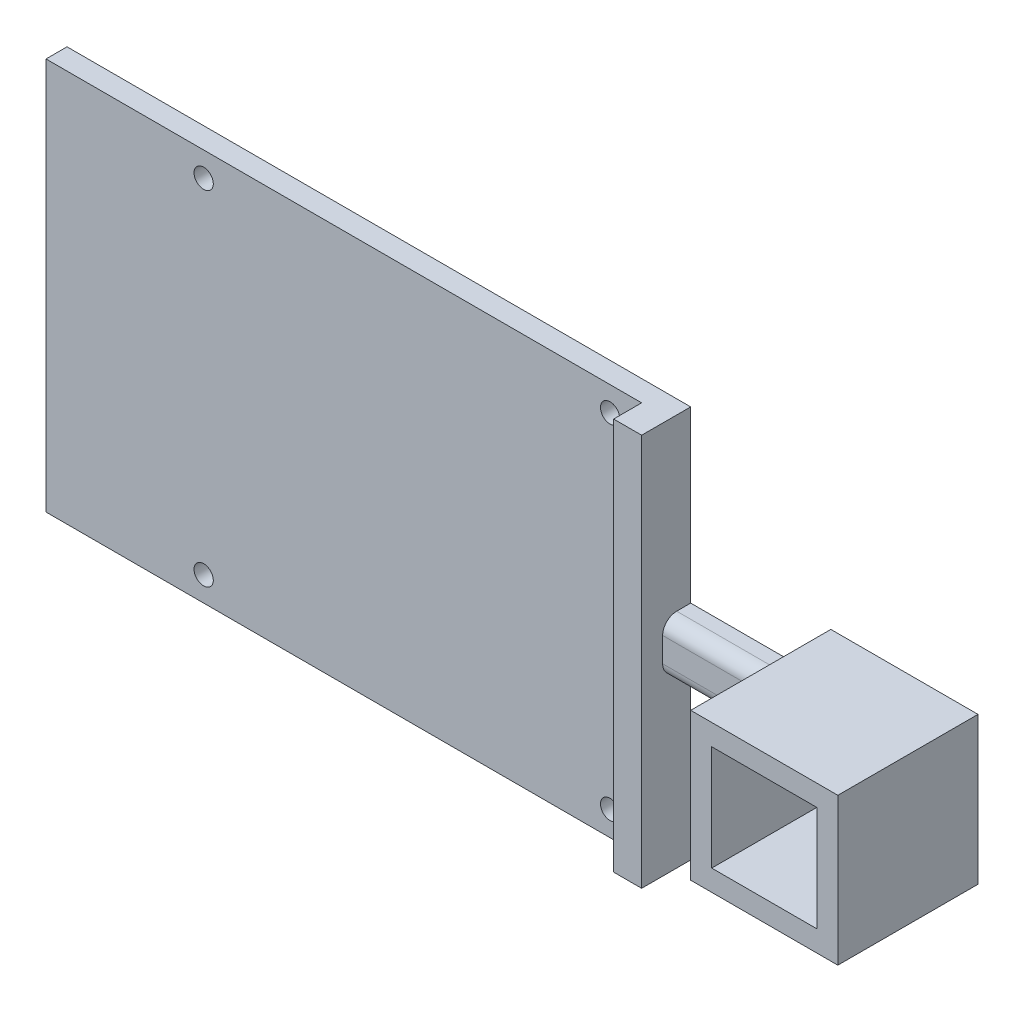
ISO-10303-21;
HEADER;
FILE_DESCRIPTION(('STEP AP214'),'2;1');
FILE_NAME('part.step','',(''),(''),'','','');
FILE_SCHEMA(('AUTOMOTIVE_DESIGN { 1 0 10303 214 1 1 1 1 }'));
ENDSEC;
DATA;
#1=APPLICATION_CONTEXT('core data for automotive mechanical design processes');
#2=APPLICATION_PROTOCOL_DEFINITION('international standard','automotive_design',2000,#1);
#3=PRODUCT_CONTEXT('',#1,'mechanical');
#4=PRODUCT('Part','Part','',(#3));
#5=PRODUCT_RELATED_PRODUCT_CATEGORY('part','',(#4));
#6=PRODUCT_DEFINITION_FORMATION('','',#4);
#7=PRODUCT_DEFINITION_CONTEXT('part definition',#1,'design');
#8=PRODUCT_DEFINITION('design','',#6,#7);
#9=PRODUCT_DEFINITION_SHAPE('','',#8);
#10=(LENGTH_UNIT() NAMED_UNIT(*) SI_UNIT(.MILLI.,.METRE.));
#11=(NAMED_UNIT(*) PLANE_ANGLE_UNIT() SI_UNIT($,.RADIAN.));
#12=(NAMED_UNIT(*) SI_UNIT($,.STERADIAN.) SOLID_ANGLE_UNIT());
#13=UNCERTAINTY_MEASURE_WITH_UNIT(LENGTH_MEASURE(1.E-05),#10,'distance_accuracy_value','');
#14=(GEOMETRIC_REPRESENTATION_CONTEXT(3) GLOBAL_UNCERTAINTY_ASSIGNED_CONTEXT((#13)) GLOBAL_UNIT_ASSIGNED_CONTEXT((#10,
#11,#12)) REPRESENTATION_CONTEXT('',''));
#15=CARTESIAN_POINT('',(0.,0.,0.));
#16=DIRECTION('',(0.,0.,1.));
#17=DIRECTION('',(1.,0.,0.));
#18=AXIS2_PLACEMENT_3D('',#15,#16,#17);
#19=CARTESIAN_POINT('',(-34.5,0.,0.));
#20=DIRECTION('',(1.,0.,0.));
#21=DIRECTION('',(0.,0.,-1.));
#22=AXIS2_PLACEMENT_3D('',#19,#20,#21);
#23=PLANE('',#22);
#24=DIRECTION('',(0.,1.,0.));
#25=VECTOR('',#24,1.);
#26=CARTESIAN_POINT('',(-34.5,28.,3.));
#27=LINE('',#26,#25);
#28=CARTESIAN_POINT('',(-34.5,-28.,3.));
#29=VERTEX_POINT('',#28);
#30=CARTESIAN_POINT('',(-34.5,28.,3.));
#31=VERTEX_POINT('',#30);
#32=EDGE_CURVE('E48',#29,#31,#27,.T.);
#33=ORIENTED_EDGE('',*,*,#32,.F.);
#34=DIRECTION('',(0.,0.,1.));
#35=VECTOR('',#34,1.);
#36=CARTESIAN_POINT('',(-34.5,-28.,0.));
#37=LINE('',#36,#35);
#38=CARTESIAN_POINT('',(-34.5,-28.,7.));
#39=VERTEX_POINT('',#38);
#40=EDGE_CURVE('E209',#29,#39,#37,.T.);
#41=ORIENTED_EDGE('',*,*,#40,.T.);
#42=DIRECTION('',(0.,1.,0.));
#43=VECTOR('',#42,1.);
#44=CARTESIAN_POINT('',(-34.5,-28.,7.));
#45=LINE('',#44,#43);
#46=CARTESIAN_POINT('',(-34.5,28.,7.));
#47=VERTEX_POINT('',#46);
#48=EDGE_CURVE('E211',#39,#47,#45,.T.);
#49=ORIENTED_EDGE('',*,*,#48,.T.);
#50=DIRECTION('',(0.,0.,-1.));
#51=VECTOR('',#50,1.);
#52=CARTESIAN_POINT('',(-34.5,28.,0.));
#53=LINE('',#52,#51);
#54=EDGE_CURVE('E214',#47,#31,#53,.T.);
#55=ORIENTED_EDGE('',*,*,#54,.T.);
#56=EDGE_LOOP('',(#33,#41,#49,#55));
#57=FACE_BOUND('',#56,.T.);
#58=ADVANCED_FACE('F33',(#57),#23,.F.);
#59=CARTESIAN_POINT('',(-10.5,-10.5,20.));
#60=DIRECTION('',(1.,0.,0.));
#61=DIRECTION('',(0.,0.,-1.));
#62=AXIS2_PLACEMENT_3D('',#59,#60,#61);
#63=PLANE('',#62);
#64=DIRECTION('',(0.,0.,-1.));
#65=VECTOR('',#64,1.);
#66=CARTESIAN_POINT('',(-10.5,3.75,0.));
#67=LINE('',#66,#65);
#68=CARTESIAN_POINT('',(-10.5,3.75,2.));
#69=VERTEX_POINT('',#68);
#70=CARTESIAN_POINT('',(-10.5,3.75,0.));
#71=VERTEX_POINT('',#70);
#72=EDGE_CURVE('E235',#69,#71,#67,.T.);
#73=ORIENTED_EDGE('',*,*,#72,.F.);
#74=CARTESIAN_POINT('',(-10.5,1.75000000000001,2.));
#75=DIRECTION('',(1.,0.,0.));
#76=DIRECTION('',(0.,0.,-1.));
#77=AXIS2_PLACEMENT_3D('',#74,#75,#76);
#78=CIRCLE('',#77,2.);
#79=CARTESIAN_POINT('',(-10.5,1.75000000000001,4.));
#80=VERTEX_POINT('',#79);
#81=EDGE_CURVE('E11',#69,#80,#78,.T.);
#82=ORIENTED_EDGE('',*,*,#81,.T.);
#83=DIRECTION('',(0.,1.,0.));
#84=VECTOR('',#83,1.);
#85=CARTESIAN_POINT('',(-10.5,3.75000000000001,4.));
#86=LINE('',#85,#84);
#87=CARTESIAN_POINT('',(-10.5,-1.74999999999999,4.));
#88=VERTEX_POINT('',#87);
#89=EDGE_CURVE('E244',#88,#80,#86,.T.);
#90=ORIENTED_EDGE('',*,*,#89,.F.);
#91=CARTESIAN_POINT('',(-10.5,-1.74999999999999,2.));
#92=DIRECTION('',(1.,0.,0.));
#93=DIRECTION('',(0.,0.,-1.));
#94=AXIS2_PLACEMENT_3D('',#91,#92,#93);
#95=CIRCLE('',#94,2.);
#96=CARTESIAN_POINT('',(-10.5,-3.74999999999999,2.));
#97=VERTEX_POINT('',#96);
#98=EDGE_CURVE('E41',#88,#97,#95,.T.);
#99=ORIENTED_EDGE('',*,*,#98,.T.);
#100=DIRECTION('',(0.,0.,1.));
#101=VECTOR('',#100,1.);
#102=CARTESIAN_POINT('',(-10.5,-3.74999999999999,0.));
#103=LINE('',#102,#101);
#104=CARTESIAN_POINT('',(-10.5,-3.74999999999999,0.));
#105=VERTEX_POINT('',#104);
#106=EDGE_CURVE('E181',#105,#97,#103,.T.);
#107=ORIENTED_EDGE('',*,*,#106,.F.);
#108=DIRECTION('',(0.,-1.,0.));
#109=VECTOR('',#108,1.);
#110=CARTESIAN_POINT('',(-10.5,-10.5,0.));
#111=LINE('',#110,#109);
#112=CARTESIAN_POINT('',(-10.5,-10.5,0.));
#113=VERTEX_POINT('',#112);
#114=EDGE_CURVE('E279',#105,#113,#111,.T.);
#115=ORIENTED_EDGE('',*,*,#114,.T.);
#116=DIRECTION('',(0.,0.,-1.));
#117=VECTOR('',#116,1.);
#118=CARTESIAN_POINT('',(-10.5,-10.5,20.));
#119=LINE('',#118,#117);
#120=CARTESIAN_POINT('',(-10.5,-10.5,20.));
#121=VERTEX_POINT('',#120);
#122=EDGE_CURVE('E313',#121,#113,#119,.T.);
#123=ORIENTED_EDGE('',*,*,#122,.F.);
#124=DIRECTION('',(0.,-1.,0.));
#125=VECTOR('',#124,1.);
#126=CARTESIAN_POINT('',(-10.5,-10.5,20.));
#127=LINE('',#126,#125);
#128=CARTESIAN_POINT('',(-10.5,10.5,20.));
#129=VERTEX_POINT('',#128);
#130=EDGE_CURVE('E286',#129,#121,#127,.T.);
#131=ORIENTED_EDGE('',*,*,#130,.F.);
#132=DIRECTION('',(0.,0.,-1.));
#133=VECTOR('',#132,1.);
#134=CARTESIAN_POINT('',(-10.5,10.5,20.));
#135=LINE('',#134,#133);
#136=CARTESIAN_POINT('',(-10.5,10.5,0.));
#137=VERTEX_POINT('',#136);
#138=EDGE_CURVE('E296',#129,#137,#135,.T.);
#139=ORIENTED_EDGE('',*,*,#138,.T.);
#140=EDGE_CURVE('E297',#137,#71,#111,.T.);
#141=ORIENTED_EDGE('',*,*,#140,.T.);
#142=EDGE_LOOP('',(#73,#82,#90,#99,#107,#115,#123,#131,#139,#141));
#143=FACE_BOUND('',#142,.T.);
#144=ADVANCED_FACE('F333',(#143),#63,.F.);
#145=CARTESIAN_POINT('',(10.5,-10.5,20.));
#146=DIRECTION('',(0.,1.,0.));
#147=DIRECTION('',(-1.,0.,0.));
#148=AXIS2_PLACEMENT_3D('',#145,#146,#147);
#149=PLANE('',#148);
#150=DIRECTION('',(1.,0.,0.));
#151=VECTOR('',#150,1.);
#152=CARTESIAN_POINT('',(10.5,-10.5,0.));
#153=LINE('',#152,#151);
#154=CARTESIAN_POINT('',(10.5,-10.5,0.));
#155=VERTEX_POINT('',#154);
#156=EDGE_CURVE('E300',#113,#155,#153,.T.);
#157=ORIENTED_EDGE('',*,*,#156,.T.);
#158=DIRECTION('',(0.,0.,-1.));
#159=VECTOR('',#158,1.);
#160=CARTESIAN_POINT('',(10.5,-10.5,20.));
#161=LINE('',#160,#159);
#162=CARTESIAN_POINT('',(10.5,-10.5,20.));
#163=VERTEX_POINT('',#162);
#164=EDGE_CURVE('E310',#163,#155,#161,.T.);
#165=ORIENTED_EDGE('',*,*,#164,.F.);
#166=DIRECTION('',(1.,0.,0.));
#167=VECTOR('',#166,1.);
#168=CARTESIAN_POINT('',(10.5,-10.5,20.));
#169=LINE('',#168,#167);
#170=EDGE_CURVE('E289',#121,#163,#169,.T.);
#171=ORIENTED_EDGE('',*,*,#170,.F.);
#172=ORIENTED_EDGE('',*,*,#122,.T.);
#173=EDGE_LOOP('',(#157,#165,#171,#172));
#174=FACE_BOUND('',#173,.T.);
#175=ADVANCED_FACE('F349',(#174),#149,.F.);
#176=CARTESIAN_POINT('',(10.5,-10.5,20.));
#177=DIRECTION('',(-1.,0.,0.));
#178=DIRECTION('',(0.,0.,1.));
#179=AXIS2_PLACEMENT_3D('',#176,#177,#178);
#180=PLANE('',#179);
#181=DIRECTION('',(0.,1.,0.));
#182=VECTOR('',#181,1.);
#183=CARTESIAN_POINT('',(10.5,-10.5,0.));
#184=LINE('',#183,#182);
#185=CARTESIAN_POINT('',(10.5,10.5,0.));
#186=VERTEX_POINT('',#185);
#187=EDGE_CURVE('E302',#155,#186,#184,.T.);
#188=ORIENTED_EDGE('',*,*,#187,.T.);
#189=DIRECTION('',(0.,0.,-1.));
#190=VECTOR('',#189,1.);
#191=CARTESIAN_POINT('',(10.5,10.5,20.));
#192=LINE('',#191,#190);
#193=CARTESIAN_POINT('',(10.5,10.5,20.));
#194=VERTEX_POINT('',#193);
#195=EDGE_CURVE('E307',#194,#186,#192,.T.);
#196=ORIENTED_EDGE('',*,*,#195,.F.);
#197=DIRECTION('',(0.,1.,0.));
#198=VECTOR('',#197,1.);
#199=CARTESIAN_POINT('',(10.5,-10.5,20.));
#200=LINE('',#199,#198);
#201=EDGE_CURVE('E292',#163,#194,#200,.T.);
#202=ORIENTED_EDGE('',*,*,#201,.F.);
#203=ORIENTED_EDGE('',*,*,#164,.T.);
#204=EDGE_LOOP('',(#188,#196,#202,#203));
#205=FACE_BOUND('',#204,.T.);
#206=ADVANCED_FACE('F410',(#205),#180,.F.);
#207=CARTESIAN_POINT('',(10.5,10.5,20.));
#208=DIRECTION('',(0.,-1.,0.));
#209=DIRECTION('',(1.,0.,0.));
#210=AXIS2_PLACEMENT_3D('',#207,#208,#209);
#211=PLANE('',#210);
#212=DIRECTION('',(-1.,0.,0.));
#213=VECTOR('',#212,1.);
#214=CARTESIAN_POINT('',(10.5,10.5,0.));
#215=LINE('',#214,#213);
#216=EDGE_CURVE('E290',#186,#137,#215,.T.);
#217=ORIENTED_EDGE('',*,*,#216,.T.);
#218=ORIENTED_EDGE('',*,*,#138,.F.);
#219=DIRECTION('',(-1.,0.,0.));
#220=VECTOR('',#219,1.);
#221=CARTESIAN_POINT('',(10.5,10.5,20.));
#222=LINE('',#221,#220);
#223=EDGE_CURVE('E294',#194,#129,#222,.T.);
#224=ORIENTED_EDGE('',*,*,#223,.F.);
#225=ORIENTED_EDGE('',*,*,#195,.T.);
#226=EDGE_LOOP('',(#217,#218,#224,#225));
#227=FACE_BOUND('',#226,.T.);
#228=ADVANCED_FACE('F358',(#227),#211,.F.);
#229=CARTESIAN_POINT('',(0.,0.,20.));
#230=DIRECTION('',(0.,0.,1.));
#231=DIRECTION('',(1.,0.,0.));
#232=AXIS2_PLACEMENT_3D('',#229,#230,#231);
#233=PLANE('',#232);
#234=DIRECTION('',(0.,-1.,0.));
#235=VECTOR('',#234,1.);
#236=CARTESIAN_POINT('',(-7.5,-7.5,20.));
#237=LINE('',#236,#235);
#238=CARTESIAN_POINT('',(-7.5,7.5,20.));
#239=VERTEX_POINT('',#238);
#240=CARTESIAN_POINT('',(-7.5,-7.5,20.));
#241=VERTEX_POINT('',#240);
#242=EDGE_CURVE('E253',#239,#241,#237,.T.);
#243=ORIENTED_EDGE('',*,*,#242,.F.);
#244=DIRECTION('',(-1.,0.,0.));
#245=VECTOR('',#244,1.);
#246=CARTESIAN_POINT('',(7.5,7.5,20.));
#247=LINE('',#246,#245);
#248=CARTESIAN_POINT('',(7.5,7.5,20.));
#249=VERTEX_POINT('',#248);
#250=EDGE_CURVE('E258',#249,#239,#247,.T.);
#251=ORIENTED_EDGE('',*,*,#250,.F.);
#252=DIRECTION('',(0.,1.,0.));
#253=VECTOR('',#252,1.);
#254=CARTESIAN_POINT('',(7.5,-7.5,20.));
#255=LINE('',#254,#253);
#256=CARTESIAN_POINT('',(7.5,-7.5,20.));
#257=VERTEX_POINT('',#256);
#258=EDGE_CURVE('E272',#257,#249,#255,.T.);
#259=ORIENTED_EDGE('',*,*,#258,.F.);
#260=DIRECTION('',(1.,0.,0.));
#261=VECTOR('',#260,1.);
#262=CARTESIAN_POINT('',(7.5,-7.5,20.));
#263=LINE('',#262,#261);
#264=EDGE_CURVE('E269',#241,#257,#263,.T.);
#265=ORIENTED_EDGE('',*,*,#264,.F.);
#266=EDGE_LOOP('',(#243,#251,#259,#265));
#267=FACE_BOUND('',#266,.T.);
#268=ORIENTED_EDGE('',*,*,#130,.T.);
#269=ORIENTED_EDGE('',*,*,#170,.T.);
#270=ORIENTED_EDGE('',*,*,#201,.T.);
#271=ORIENTED_EDGE('',*,*,#223,.T.);
#272=EDGE_LOOP('',(#268,#269,#270,#271));
#273=FACE_BOUND('',#272,.T.);
#274=ADVANCED_FACE('F353',(#267,#273),#233,.T.);
#275=CARTESIAN_POINT('',(0.,0.,0.));
#276=DIRECTION('',(0.,0.,1.));
#277=DIRECTION('',(1.,0.,0.));
#278=AXIS2_PLACEMENT_3D('',#275,#276,#277);
#279=PLANE('',#278);
#280=CARTESIAN_POINT('',(-39.,24.5,0.));
#281=DIRECTION('',(0.,0.,1.));
#282=DIRECTION('',(1.,0.,0.));
#283=AXIS2_PLACEMENT_3D('',#280,#281,#282);
#284=CIRCLE('',#283,1.375);
#285=CARTESIAN_POINT('',(-37.625,24.5,0.));
#286=VERTEX_POINT('',#285);
#287=EDGE_CURVE('E198',#286,#286,#284,.T.);
#288=ORIENTED_EDGE('',*,*,#287,.T.);
#289=EDGE_LOOP('',(#288));
#290=FACE_BOUND('',#289,.T.);
#291=CARTESIAN_POINT('',(-97.,-24.5,0.));
#292=DIRECTION('',(0.,0.,1.));
#293=DIRECTION('',(1.,0.,0.));
#294=AXIS2_PLACEMENT_3D('',#291,#292,#293);
#295=CIRCLE('',#294,1.375);
#296=CARTESIAN_POINT('',(-95.625,-24.5,0.));
#297=VERTEX_POINT('',#296);
#298=EDGE_CURVE('E593',#297,#297,#295,.T.);
#299=ORIENTED_EDGE('',*,*,#298,.T.);
#300=EDGE_LOOP('',(#299));
#301=FACE_BOUND('',#300,.T.);
#302=CARTESIAN_POINT('',(-97.,24.5,0.));
#303=DIRECTION('',(0.,0.,1.));
#304=DIRECTION('',(1.,0.,0.));
#305=AXIS2_PLACEMENT_3D('',#302,#303,#304);
#306=CIRCLE('',#305,1.375);
#307=CARTESIAN_POINT('',(-95.625,24.5,0.));
#308=VERTEX_POINT('',#307);
#309=EDGE_CURVE('E595',#308,#308,#306,.T.);
#310=ORIENTED_EDGE('',*,*,#309,.T.);
#311=EDGE_LOOP('',(#310));
#312=FACE_BOUND('',#311,.T.);
#313=CARTESIAN_POINT('',(-39.,-24.5,0.));
#314=DIRECTION('',(0.,0.,1.));
#315=DIRECTION('',(1.,0.,0.));
#316=AXIS2_PLACEMENT_3D('',#313,#314,#315);
#317=CIRCLE('',#316,1.375);
#318=CARTESIAN_POINT('',(-37.625,-24.5,0.));
#319=VERTEX_POINT('',#318);
#320=EDGE_CURVE('E599',#319,#319,#317,.T.);
#321=ORIENTED_EDGE('',*,*,#320,.T.);
#322=EDGE_LOOP('',(#321));
#323=FACE_BOUND('',#322,.T.);
#324=DIRECTION('',(-1.,0.,0.));
#325=VECTOR('',#324,1.);
#326=CARTESIAN_POINT('',(7.5,7.5,0.));
#327=LINE('',#326,#325);
#328=CARTESIAN_POINT('',(7.5,7.5,0.));
#329=VERTEX_POINT('',#328);
#330=CARTESIAN_POINT('',(-7.5,7.5,0.));
#331=VERTEX_POINT('',#330);
#332=EDGE_CURVE('E264',#329,#331,#327,.T.);
#333=ORIENTED_EDGE('',*,*,#332,.T.);
#334=DIRECTION('',(0.,-1.,0.));
#335=VECTOR('',#334,1.);
#336=CARTESIAN_POINT('',(-7.5,-7.5,0.));
#337=LINE('',#336,#335);
#338=CARTESIAN_POINT('',(-7.5,-7.5,0.));
#339=VERTEX_POINT('',#338);
#340=EDGE_CURVE('E254',#331,#339,#337,.T.);
#341=ORIENTED_EDGE('',*,*,#340,.T.);
#342=DIRECTION('',(1.,0.,0.));
#343=VECTOR('',#342,1.);
#344=CARTESIAN_POINT('',(7.5,-7.5,0.));
#345=LINE('',#344,#343);
#346=CARTESIAN_POINT('',(7.5,-7.5,0.));
#347=VERTEX_POINT('',#346);
#348=EDGE_CURVE('E257',#339,#347,#345,.T.);
#349=ORIENTED_EDGE('',*,*,#348,.T.);
#350=DIRECTION('',(0.,1.,0.));
#351=VECTOR('',#350,1.);
#352=CARTESIAN_POINT('',(7.5,-7.5,0.));
#353=LINE('',#352,#351);
#354=EDGE_CURVE('E261',#347,#329,#353,.T.);
#355=ORIENTED_EDGE('',*,*,#354,.T.);
#356=EDGE_LOOP('',(#333,#341,#349,#355));
#357=FACE_BOUND('',#356,.T.);
#358=ORIENTED_EDGE('',*,*,#140,.F.);
#359=ORIENTED_EDGE('',*,*,#216,.F.);
#360=ORIENTED_EDGE('',*,*,#187,.F.);
#361=ORIENTED_EDGE('',*,*,#156,.F.);
#362=ORIENTED_EDGE('',*,*,#114,.F.);
#363=DIRECTION('',(1.,0.,0.));
#364=VECTOR('',#363,1.);
#365=CARTESIAN_POINT('',(-30.5,-3.74999999999999,0.));
#366=LINE('',#365,#364);
#367=CARTESIAN_POINT('',(-30.5,-3.74999999999999,0.));
#368=VERTEX_POINT('',#367);
#369=EDGE_CURVE('E250',#368,#105,#366,.T.);
#370=ORIENTED_EDGE('',*,*,#369,.F.);
#371=DIRECTION('',(0.,-1.,0.));
#372=VECTOR('',#371,1.);
#373=CARTESIAN_POINT('',(-30.5,-28.,0.));
#374=LINE('',#373,#372);
#375=CARTESIAN_POINT('',(-30.5,-28.,0.));
#376=VERTEX_POINT('',#375);
#377=EDGE_CURVE('E178',#368,#376,#374,.T.);
#378=ORIENTED_EDGE('',*,*,#377,.T.);
#379=DIRECTION('',(1.,0.,0.));
#380=VECTOR('',#379,1.);
#381=CARTESIAN_POINT('',(-34.5,-28.,0.));
#382=LINE('',#381,#380);
#383=CARTESIAN_POINT('',(-119.5,-28.,0.));
#384=VERTEX_POINT('',#383);
#385=EDGE_CURVE('E169',#384,#376,#382,.T.);
#386=ORIENTED_EDGE('',*,*,#385,.F.);
#387=DIRECTION('',(0.,-1.,0.));
#388=VECTOR('',#387,1.);
#389=CARTESIAN_POINT('',(-119.5,28.,0.));
#390=LINE('',#389,#388);
#391=CARTESIAN_POINT('',(-119.5,28.,0.));
#392=VERTEX_POINT('',#391);
#393=EDGE_CURVE('E175',#392,#384,#390,.T.);
#394=ORIENTED_EDGE('',*,*,#393,.F.);
#395=DIRECTION('',(1.,0.,0.));
#396=VECTOR('',#395,1.);
#397=CARTESIAN_POINT('',(-34.5,28.,0.));
#398=LINE('',#397,#396);
#399=CARTESIAN_POINT('',(-30.5,28.,0.));
#400=VERTEX_POINT('',#399);
#401=EDGE_CURVE('E216',#392,#400,#398,.T.);
#402=ORIENTED_EDGE('',*,*,#401,.T.);
#403=CARTESIAN_POINT('',(-30.5,3.75000000000001,0.));
#404=VERTEX_POINT('',#403);
#405=EDGE_CURVE('E217',#400,#404,#374,.T.);
#406=ORIENTED_EDGE('',*,*,#405,.T.);
#407=DIRECTION('',(1.,0.,0.));
#408=VECTOR('',#407,1.);
#409=CARTESIAN_POINT('',(-30.5,3.75,0.));
#410=LINE('',#409,#408);
#411=EDGE_CURVE('E241',#404,#71,#410,.T.);
#412=ORIENTED_EDGE('',*,*,#411,.T.);
#413=EDGE_LOOP('',(#358,#359,#360,#361,#362,#370,#378,#386,#394,#402,#406,#412));
#414=FACE_BOUND('',#413,.T.);
#415=ADVANCED_FACE('F172',(#290,#301,#312,#323,#357,#414),#279,.F.);
#416=CARTESIAN_POINT('',(-7.5,-7.5,0.));
#417=DIRECTION('',(-1.,0.,0.));
#418=DIRECTION('',(0.,0.,1.));
#419=AXIS2_PLACEMENT_3D('',#416,#417,#418);
#420=PLANE('',#419);
#421=ORIENTED_EDGE('',*,*,#242,.T.);
#422=DIRECTION('',(0.,0.,1.));
#423=VECTOR('',#422,1.);
#424=CARTESIAN_POINT('',(-7.5,-7.5,0.));
#425=LINE('',#424,#423);
#426=EDGE_CURVE('E267',#339,#241,#425,.T.);
#427=ORIENTED_EDGE('',*,*,#426,.F.);
#428=ORIENTED_EDGE('',*,*,#340,.F.);
#429=DIRECTION('',(0.,0.,1.));
#430=VECTOR('',#429,1.);
#431=CARTESIAN_POINT('',(-7.5,7.5,0.));
#432=LINE('',#431,#430);
#433=EDGE_CURVE('E277',#331,#239,#432,.T.);
#434=ORIENTED_EDGE('',*,*,#433,.T.);
#435=EDGE_LOOP('',(#421,#427,#428,#434));
#436=FACE_BOUND('',#435,.T.);
#437=ADVANCED_FACE('F417',(#436),#420,.F.);
#438=CARTESIAN_POINT('',(7.5,7.5,0.));
#439=DIRECTION('',(0.,1.,0.));
#440=DIRECTION('',(-1.,0.,0.));
#441=AXIS2_PLACEMENT_3D('',#438,#439,#440);
#442=PLANE('',#441);
#443=ORIENTED_EDGE('',*,*,#250,.T.);
#444=ORIENTED_EDGE('',*,*,#433,.F.);
#445=ORIENTED_EDGE('',*,*,#332,.F.);
#446=DIRECTION('',(0.,0.,1.));
#447=VECTOR('',#446,1.);
#448=CARTESIAN_POINT('',(7.5,7.5,0.));
#449=LINE('',#448,#447);
#450=EDGE_CURVE('E280',#329,#249,#449,.T.);
#451=ORIENTED_EDGE('',*,*,#450,.T.);
#452=EDGE_LOOP('',(#443,#444,#445,#451));
#453=FACE_BOUND('',#452,.T.);
#454=ADVANCED_FACE('F424',(#453),#442,.F.);
#455=CARTESIAN_POINT('',(7.5,-7.5,0.));
#456=DIRECTION('',(1.,0.,0.));
#457=DIRECTION('',(0.,0.,-1.));
#458=AXIS2_PLACEMENT_3D('',#455,#456,#457);
#459=PLANE('',#458);
#460=ORIENTED_EDGE('',*,*,#258,.T.);
#461=ORIENTED_EDGE('',*,*,#450,.F.);
#462=ORIENTED_EDGE('',*,*,#354,.F.);
#463=DIRECTION('',(0.,0.,1.));
#464=VECTOR('',#463,1.);
#465=CARTESIAN_POINT('',(7.5,-7.5,0.));
#466=LINE('',#465,#464);
#467=EDGE_CURVE('E282',#347,#257,#466,.T.);
#468=ORIENTED_EDGE('',*,*,#467,.T.);
#469=EDGE_LOOP('',(#460,#461,#462,#468));
#470=FACE_BOUND('',#469,.T.);
#471=ADVANCED_FACE('F428',(#470),#459,.F.);
#472=CARTESIAN_POINT('',(7.5,-7.5,0.));
#473=DIRECTION('',(0.,-1.,0.));
#474=DIRECTION('',(1.,0.,0.));
#475=AXIS2_PLACEMENT_3D('',#472,#473,#474);
#476=PLANE('',#475);
#477=ORIENTED_EDGE('',*,*,#264,.T.);
#478=ORIENTED_EDGE('',*,*,#467,.F.);
#479=ORIENTED_EDGE('',*,*,#348,.F.);
#480=ORIENTED_EDGE('',*,*,#426,.T.);
#481=EDGE_LOOP('',(#477,#478,#479,#480));
#482=FACE_BOUND('',#481,.T.);
#483=ADVANCED_FACE('F374',(#482),#476,.F.);
#484=CARTESIAN_POINT('',(-30.5,-3.74999999999999,0.));
#485=DIRECTION('',(0.,1.,0.));
#486=DIRECTION('',(0.,0.,1.));
#487=AXIS2_PLACEMENT_3D('',#484,#485,#486);
#488=PLANE('',#487);
#489=ORIENTED_EDGE('',*,*,#106,.T.);
#490=DIRECTION('',(1.,0.,0.));
#491=VECTOR('',#490,1.);
#492=CARTESIAN_POINT('',(-30.5,-3.74999999999999,2.));
#493=LINE('',#492,#491);
#494=CARTESIAN_POINT('',(-30.5,-3.74999999999999,2.));
#495=VERTEX_POINT('',#494);
#496=EDGE_CURVE('E321',#97,#495,#493,.F.);
#497=ORIENTED_EDGE('',*,*,#496,.T.);
#498=DIRECTION('',(0.,0.,1.));
#499=VECTOR('',#498,1.);
#500=CARTESIAN_POINT('',(-30.5,-3.74999999999999,0.));
#501=LINE('',#500,#499);
#502=EDGE_CURVE('E231',#368,#495,#501,.T.);
#503=ORIENTED_EDGE('',*,*,#502,.F.);
#504=ORIENTED_EDGE('',*,*,#369,.T.);
#505=EDGE_LOOP('',(#489,#497,#503,#504));
#506=FACE_BOUND('',#505,.T.);
#507=ADVANCED_FACE('F339',(#506),#488,.F.);
#508=CARTESIAN_POINT('',(-30.5,3.75000000000001,4.));
#509=DIRECTION('',(0.,0.,-1.));
#510=DIRECTION('',(0.,1.,0.));
#511=AXIS2_PLACEMENT_3D('',#508,#509,#510);
#512=PLANE('',#511);
#513=DIRECTION('',(0.,1.,0.));
#514=VECTOR('',#513,1.);
#515=CARTESIAN_POINT('',(-30.5,3.75000000000001,4.));
#516=LINE('',#515,#514);
#517=CARTESIAN_POINT('',(-30.5,-1.74999999999999,4.));
#518=VERTEX_POINT('',#517);
#519=CARTESIAN_POINT('',(-30.5,1.75000000000001,4.));
#520=VERTEX_POINT('',#519);
#521=EDGE_CURVE('E234',#518,#520,#516,.T.);
#522=ORIENTED_EDGE('',*,*,#521,.F.);
#523=DIRECTION('',(1.,0.,0.));
#524=VECTOR('',#523,1.);
#525=CARTESIAN_POINT('',(-30.5,-1.74999999999999,4.));
#526=LINE('',#525,#524);
#527=EDGE_CURVE('E318',#518,#88,#526,.T.);
#528=ORIENTED_EDGE('',*,*,#527,.T.);
#529=ORIENTED_EDGE('',*,*,#89,.T.);
#530=DIRECTION('',(1.,0.,0.));
#531=VECTOR('',#530,1.);
#532=CARTESIAN_POINT('',(-30.5,1.75000000000001,4.));
#533=LINE('',#532,#531);
#534=EDGE_CURVE('E316',#80,#520,#533,.F.);
#535=ORIENTED_EDGE('',*,*,#534,.T.);
#536=EDGE_LOOP('',(#522,#528,#529,#535));
#537=FACE_BOUND('',#536,.T.);
#538=ADVANCED_FACE('F366',(#537),#512,.F.);
#539=CARTESIAN_POINT('',(-30.5,3.75,0.));
#540=DIRECTION('',(0.,-1.,0.));
#541=DIRECTION('',(0.,0.,-1.));
#542=AXIS2_PLACEMENT_3D('',#539,#540,#541);
#543=PLANE('',#542);
#544=DIRECTION('',(0.,0.,-1.));
#545=VECTOR('',#544,1.);
#546=CARTESIAN_POINT('',(-30.5,3.75,0.));
#547=LINE('',#546,#545);
#548=CARTESIAN_POINT('',(-30.5,3.75,2.));
#549=VERTEX_POINT('',#548);
#550=EDGE_CURVE('E238',#549,#404,#547,.T.);
#551=ORIENTED_EDGE('',*,*,#550,.F.);
#552=DIRECTION('',(1.,0.,0.));
#553=VECTOR('',#552,1.);
#554=CARTESIAN_POINT('',(-30.5,3.75,2.));
#555=LINE('',#554,#553);
#556=EDGE_CURVE('E329',#549,#69,#555,.T.);
#557=ORIENTED_EDGE('',*,*,#556,.T.);
#558=ORIENTED_EDGE('',*,*,#72,.T.);
#559=ORIENTED_EDGE('',*,*,#411,.F.);
#560=EDGE_LOOP('',(#551,#557,#558,#559));
#561=FACE_BOUND('',#560,.T.);
#562=ADVANCED_FACE('F362',(#561),#543,.F.);
#563=CARTESIAN_POINT('',(-30.5,-1.74999999999999,2.));
#564=DIRECTION('',(1.,0.,0.));
#565=DIRECTION('',(0.,0.,-1.));
#566=AXIS2_PLACEMENT_3D('',#563,#564,#565);
#567=CYLINDRICAL_SURFACE('',#566,2.);
#568=CARTESIAN_POINT('',(-30.5,-1.74999999999999,2.));
#569=DIRECTION('',(-1.,0.,0.));
#570=DIRECTION('',(0.,0.,1.));
#571=AXIS2_PLACEMENT_3D('',#568,#569,#570);
#572=CIRCLE('',#571,2.);
#573=EDGE_CURVE('E326',#495,#518,#572,.T.);
#574=ORIENTED_EDGE('',*,*,#573,.F.);
#575=ORIENTED_EDGE('',*,*,#496,.F.);
#576=ORIENTED_EDGE('',*,*,#98,.F.);
#577=ORIENTED_EDGE('',*,*,#527,.F.);
#578=EDGE_LOOP('',(#574,#575,#576,#577));
#579=FACE_BOUND('',#578,.T.);
#580=ADVANCED_FACE('F341',(#579),#567,.T.);
#581=CARTESIAN_POINT('',(-30.5,1.75000000000001,2.));
#582=DIRECTION('',(1.,0.,0.));
#583=DIRECTION('',(0.,0.,-1.));
#584=AXIS2_PLACEMENT_3D('',#581,#582,#583);
#585=CYLINDRICAL_SURFACE('',#584,2.);
#586=CARTESIAN_POINT('',(-30.5,1.75000000000001,2.));
#587=DIRECTION('',(-1.,0.,0.));
#588=DIRECTION('',(0.,0.,1.));
#589=AXIS2_PLACEMENT_3D('',#586,#587,#588);
#590=CIRCLE('',#589,2.);
#591=EDGE_CURVE('E323',#520,#549,#590,.T.);
#592=ORIENTED_EDGE('',*,*,#591,.F.);
#593=ORIENTED_EDGE('',*,*,#534,.F.);
#594=ORIENTED_EDGE('',*,*,#81,.F.);
#595=ORIENTED_EDGE('',*,*,#556,.F.);
#596=EDGE_LOOP('',(#592,#593,#594,#595));
#597=FACE_BOUND('',#596,.T.);
#598=ADVANCED_FACE('F35',(#597),#585,.T.);
#599=CARTESIAN_POINT('',(-34.5,-28.,0.));
#600=DIRECTION('',(0.,1.,0.));
#601=DIRECTION('',(0.,0.,1.));
#602=AXIS2_PLACEMENT_3D('',#599,#600,#601);
#603=PLANE('',#602);
#604=DIRECTION('',(0.,0.,1.));
#605=VECTOR('',#604,1.);
#606=CARTESIAN_POINT('',(-30.5,-28.,0.));
#607=LINE('',#606,#605);
#608=CARTESIAN_POINT('',(-30.5,-28.,7.));
#609=VERTEX_POINT('',#608);
#610=EDGE_CURVE('E220',#376,#609,#607,.T.);
#611=ORIENTED_EDGE('',*,*,#610,.T.);
#612=DIRECTION('',(1.,0.,0.));
#613=VECTOR('',#612,1.);
#614=CARTESIAN_POINT('',(-34.5,-28.,7.));
#615=LINE('',#614,#613);
#616=EDGE_CURVE('E182',#39,#609,#615,.T.);
#617=ORIENTED_EDGE('',*,*,#616,.F.);
#618=ORIENTED_EDGE('',*,*,#40,.F.);
#619=DIRECTION('',(1.,0.,0.));
#620=VECTOR('',#619,1.);
#621=CARTESIAN_POINT('',(-119.5,-28.,3.00000000000001));
#622=LINE('',#621,#620);
#623=CARTESIAN_POINT('',(-119.5,-28.,3.00000000000001));
#624=VERTEX_POINT('',#623);
#625=EDGE_CURVE('E188',#624,#29,#622,.T.);
#626=ORIENTED_EDGE('',*,*,#625,.F.);
#627=DIRECTION('',(0.,0.,1.));
#628=VECTOR('',#627,1.);
#629=CARTESIAN_POINT('',(-119.5,-28.,0.));
#630=LINE('',#629,#628);
#631=EDGE_CURVE('E185',#384,#624,#630,.T.);
#632=ORIENTED_EDGE('',*,*,#631,.F.);
#633=ORIENTED_EDGE('',*,*,#385,.T.);
#634=EDGE_LOOP('',(#611,#617,#618,#626,#632,#633));
#635=FACE_BOUND('',#634,.T.);
#636=ADVANCED_FACE('F186',(#635),#603,.F.);
#637=CARTESIAN_POINT('',(-34.5,-28.,7.));
#638=DIRECTION('',(0.,0.,-1.));
#639=DIRECTION('',(-1.,0.,0.));
#640=AXIS2_PLACEMENT_3D('',#637,#638,#639);
#641=PLANE('',#640);
#642=DIRECTION('',(0.,1.,0.));
#643=VECTOR('',#642,1.);
#644=CARTESIAN_POINT('',(-30.5,-28.,7.));
#645=LINE('',#644,#643);
#646=CARTESIAN_POINT('',(-30.5,28.,7.));
#647=VERTEX_POINT('',#646);
#648=EDGE_CURVE('E222',#609,#647,#645,.T.);
#649=ORIENTED_EDGE('',*,*,#648,.T.);
#650=DIRECTION('',(1.,0.,0.));
#651=VECTOR('',#650,1.);
#652=CARTESIAN_POINT('',(-34.5,28.,7.));
#653=LINE('',#652,#651);
#654=EDGE_CURVE('E226',#47,#647,#653,.T.);
#655=ORIENTED_EDGE('',*,*,#654,.F.);
#656=ORIENTED_EDGE('',*,*,#48,.F.);
#657=ORIENTED_EDGE('',*,*,#616,.T.);
#658=EDGE_LOOP('',(#649,#655,#656,#657));
#659=FACE_BOUND('',#658,.T.);
#660=ADVANCED_FACE('F393',(#659),#641,.F.);
#661=CARTESIAN_POINT('',(-34.5,28.,0.));
#662=DIRECTION('',(0.,-1.,0.));
#663=DIRECTION('',(0.,0.,-1.));
#664=AXIS2_PLACEMENT_3D('',#661,#662,#663);
#665=PLANE('',#664);
#666=DIRECTION('',(0.,0.,-1.));
#667=VECTOR('',#666,1.);
#668=CARTESIAN_POINT('',(-30.5,28.,0.));
#669=LINE('',#668,#667);
#670=EDGE_CURVE('E212',#647,#400,#669,.T.);
#671=ORIENTED_EDGE('',*,*,#670,.T.);
#672=ORIENTED_EDGE('',*,*,#401,.F.);
#673=DIRECTION('',(0.,0.,-1.));
#674=VECTOR('',#673,1.);
#675=CARTESIAN_POINT('',(-119.5,28.,0.));
#676=LINE('',#675,#674);
#677=CARTESIAN_POINT('',(-119.5,28.,3.));
#678=VERTEX_POINT('',#677);
#679=EDGE_CURVE('E196',#678,#392,#676,.T.);
#680=ORIENTED_EDGE('',*,*,#679,.F.);
#681=DIRECTION('',(1.,0.,0.));
#682=VECTOR('',#681,1.);
#683=CARTESIAN_POINT('',(-119.5,28.,3.));
#684=LINE('',#683,#682);
#685=EDGE_CURVE('E204',#678,#31,#684,.T.);
#686=ORIENTED_EDGE('',*,*,#685,.T.);
#687=ORIENTED_EDGE('',*,*,#54,.F.);
#688=ORIENTED_EDGE('',*,*,#654,.T.);
#689=EDGE_LOOP('',(#671,#672,#680,#686,#687,#688));
#690=FACE_BOUND('',#689,.T.);
#691=ADVANCED_FACE('F390',(#690),#665,.F.);
#692=CARTESIAN_POINT('',(-30.5,0.,0.));
#693=DIRECTION('',(1.,0.,0.));
#694=DIRECTION('',(0.,0.,-1.));
#695=AXIS2_PLACEMENT_3D('',#692,#693,#694);
#696=PLANE('',#695);
#697=ORIENTED_EDGE('',*,*,#377,.F.);
#698=ORIENTED_EDGE('',*,*,#502,.T.);
#699=ORIENTED_EDGE('',*,*,#573,.T.);
#700=ORIENTED_EDGE('',*,*,#521,.T.);
#701=ORIENTED_EDGE('',*,*,#591,.T.);
#702=ORIENTED_EDGE('',*,*,#550,.T.);
#703=ORIENTED_EDGE('',*,*,#405,.F.);
#704=ORIENTED_EDGE('',*,*,#670,.F.);
#705=ORIENTED_EDGE('',*,*,#648,.F.);
#706=ORIENTED_EDGE('',*,*,#610,.F.);
#707=EDGE_LOOP('',(#697,#698,#699,#700,#701,#702,#703,#704,#705,#706));
#708=FACE_BOUND('',#707,.T.);
#709=ADVANCED_FACE('F343',(#708),#696,.T.);
#710=CARTESIAN_POINT('',(-119.5,28.,3.));
#711=DIRECTION('',(0.,0.,-1.));
#712=DIRECTION('',(0.,1.,0.));
#713=AXIS2_PLACEMENT_3D('',#710,#711,#712);
#714=PLANE('',#713);
#715=CARTESIAN_POINT('',(-39.,24.5,3.));
#716=DIRECTION('',(0.,0.,1.));
#717=DIRECTION('',(1.,0.,0.));
#718=AXIS2_PLACEMENT_3D('',#715,#716,#717);
#719=CIRCLE('',#718,1.375);
#720=CARTESIAN_POINT('',(-37.625,24.5,3.));
#721=VERTEX_POINT('',#720);
#722=EDGE_CURVE('E590',#721,#721,#719,.T.);
#723=ORIENTED_EDGE('',*,*,#722,.F.);
#724=EDGE_LOOP('',(#723));
#725=FACE_BOUND('',#724,.T.);
#726=CARTESIAN_POINT('',(-97.,-24.5,3.));
#727=DIRECTION('',(0.,0.,1.));
#728=DIRECTION('',(1.,0.,0.));
#729=AXIS2_PLACEMENT_3D('',#726,#727,#728);
#730=CIRCLE('',#729,1.375);
#731=CARTESIAN_POINT('',(-95.625,-24.5,3.));
#732=VERTEX_POINT('',#731);
#733=EDGE_CURVE('E607',#732,#732,#730,.T.);
#734=ORIENTED_EDGE('',*,*,#733,.F.);
#735=EDGE_LOOP('',(#734));
#736=FACE_BOUND('',#735,.T.);
#737=CARTESIAN_POINT('',(-97.,24.5,3.));
#738=DIRECTION('',(0.,0.,1.));
#739=DIRECTION('',(1.,0.,0.));
#740=AXIS2_PLACEMENT_3D('',#737,#738,#739);
#741=CIRCLE('',#740,1.375);
#742=CARTESIAN_POINT('',(-95.625,24.5,3.));
#743=VERTEX_POINT('',#742);
#744=EDGE_CURVE('E610',#743,#743,#741,.T.);
#745=ORIENTED_EDGE('',*,*,#744,.F.);
#746=EDGE_LOOP('',(#745));
#747=FACE_BOUND('',#746,.T.);
#748=CARTESIAN_POINT('',(-39.,-24.5,3.));
#749=DIRECTION('',(0.,0.,1.));
#750=DIRECTION('',(1.,0.,0.));
#751=AXIS2_PLACEMENT_3D('',#748,#749,#750);
#752=CIRCLE('',#751,1.375);
#753=CARTESIAN_POINT('',(-37.625,-24.5,3.));
#754=VERTEX_POINT('',#753);
#755=EDGE_CURVE('E604',#754,#754,#752,.T.);
#756=ORIENTED_EDGE('',*,*,#755,.F.);
#757=EDGE_LOOP('',(#756));
#758=FACE_BOUND('',#757,.T.);
#759=ORIENTED_EDGE('',*,*,#32,.T.);
#760=ORIENTED_EDGE('',*,*,#685,.F.);
#761=DIRECTION('',(0.,1.,0.));
#762=VECTOR('',#761,1.);
#763=CARTESIAN_POINT('',(-119.5,28.,3.));
#764=LINE('',#763,#762);
#765=EDGE_CURVE('E191',#624,#678,#764,.T.);
#766=ORIENTED_EDGE('',*,*,#765,.F.);
#767=ORIENTED_EDGE('',*,*,#625,.T.);
#768=EDGE_LOOP('',(#759,#760,#766,#767));
#769=FACE_BOUND('',#768,.T.);
#770=ADVANCED_FACE('F386',(#725,#736,#747,#758,#769),#714,.F.);
#771=CARTESIAN_POINT('',(-119.5,0.,0.));
#772=DIRECTION('',(-1.,0.,0.));
#773=DIRECTION('',(0.,0.,1.));
#774=AXIS2_PLACEMENT_3D('',#771,#772,#773);
#775=PLANE('',#774);
#776=ORIENTED_EDGE('',*,*,#393,.T.);
#777=ORIENTED_EDGE('',*,*,#631,.T.);
#778=ORIENTED_EDGE('',*,*,#765,.T.);
#779=ORIENTED_EDGE('',*,*,#679,.T.);
#780=EDGE_LOOP('',(#776,#777,#778,#779));
#781=FACE_BOUND('',#780,.T.);
#782=ADVANCED_FACE('F194',(#781),#775,.T.);
#783=CARTESIAN_POINT('',(-39.,-24.5,-0.999999999999997));
#784=DIRECTION('',(0.,0.,1.));
#785=DIRECTION('',(1.,0.,0.));
#786=AXIS2_PLACEMENT_3D('',#783,#784,#785);
#787=CYLINDRICAL_SURFACE('',#786,1.375);
#788=ORIENTED_EDGE('',*,*,#755,.T.);
#789=EDGE_LOOP('',(#788));
#790=FACE_BOUND('',#789,.T.);
#791=ORIENTED_EDGE('',*,*,#320,.F.);
#792=EDGE_LOOP('',(#791));
#793=FACE_BOUND('',#792,.T.);
#794=ADVANCED_FACE('F534',(#790,#793),#787,.F.);
#795=CARTESIAN_POINT('',(-97.,24.5,-0.999999999999997));
#796=DIRECTION('',(0.,0.,1.));
#797=DIRECTION('',(1.,0.,0.));
#798=AXIS2_PLACEMENT_3D('',#795,#796,#797);
#799=CYLINDRICAL_SURFACE('',#798,1.375);
#800=ORIENTED_EDGE('',*,*,#744,.T.);
#801=EDGE_LOOP('',(#800));
#802=FACE_BOUND('',#801,.T.);
#803=ORIENTED_EDGE('',*,*,#309,.F.);
#804=EDGE_LOOP('',(#803));
#805=FACE_BOUND('',#804,.T.);
#806=ADVANCED_FACE('F553',(#802,#805),#799,.F.);
#807=CARTESIAN_POINT('',(-97.,-24.5,-0.999999999999997));
#808=DIRECTION('',(0.,0.,1.));
#809=DIRECTION('',(1.,0.,0.));
#810=AXIS2_PLACEMENT_3D('',#807,#808,#809);
#811=CYLINDRICAL_SURFACE('',#810,1.375);
#812=ORIENTED_EDGE('',*,*,#733,.T.);
#813=EDGE_LOOP('',(#812));
#814=FACE_BOUND('',#813,.T.);
#815=ORIENTED_EDGE('',*,*,#298,.F.);
#816=EDGE_LOOP('',(#815));
#817=FACE_BOUND('',#816,.T.);
#818=ADVANCED_FACE('F563',(#814,#817),#811,.F.);
#819=CARTESIAN_POINT('',(-39.,24.5,-0.999999999999997));
#820=DIRECTION('',(0.,0.,1.));
#821=DIRECTION('',(1.,0.,0.));
#822=AXIS2_PLACEMENT_3D('',#819,#820,#821);
#823=CYLINDRICAL_SURFACE('',#822,1.375);
#824=ORIENTED_EDGE('',*,*,#722,.T.);
#825=EDGE_LOOP('',(#824));
#826=FACE_BOUND('',#825,.T.);
#827=ORIENTED_EDGE('',*,*,#287,.F.);
#828=EDGE_LOOP('',(#827));
#829=FACE_BOUND('',#828,.T.);
#830=ADVANCED_FACE('F573',(#826,#829),#823,.F.);
#831=CLOSED_SHELL('',(#58,#144,#175,#206,#228,#274,#415,#437,#454,#471,#483,#507,#538,#562,#580,
#598,#636,#660,#691,#709,#770,#782,#794,#806,#818,#830));
#832=MANIFOLD_SOLID_BREP('B2',#831);
#833=ADVANCED_BREP_SHAPE_REPRESENTATION('',(#18,#832),#14);
#834=SHAPE_DEFINITION_REPRESENTATION(#9,#833);
ENDSEC;
END-ISO-10303-21;
